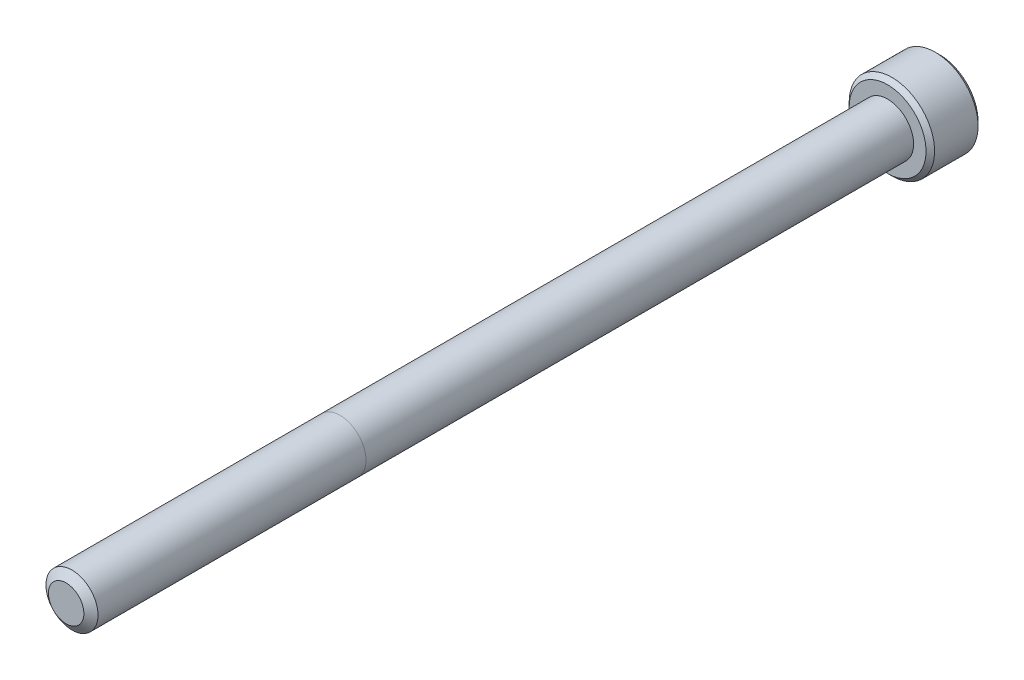
ISO-10303-21;
HEADER;
FILE_DESCRIPTION(('STEP AP214'),'2;1');
FILE_NAME('part.step','',(''),(''),'','','');
FILE_SCHEMA(('AUTOMOTIVE_DESIGN { 1 0 10303 214 1 1 1 1 }'));
ENDSEC;
DATA;
#1=APPLICATION_CONTEXT('core data for automotive mechanical design processes');
#2=APPLICATION_PROTOCOL_DEFINITION('international standard','automotive_design',2000,#1);
#3=PRODUCT_CONTEXT('',#1,'mechanical');
#4=PRODUCT('Part','Part','',(#3));
#5=PRODUCT_RELATED_PRODUCT_CATEGORY('part','',(#4));
#6=PRODUCT_DEFINITION_FORMATION('','',#4);
#7=PRODUCT_DEFINITION_CONTEXT('part definition',#1,'design');
#8=PRODUCT_DEFINITION('design','',#6,#7);
#9=PRODUCT_DEFINITION_SHAPE('','',#8);
#10=(LENGTH_UNIT() NAMED_UNIT(*) SI_UNIT(.MILLI.,.METRE.));
#11=(NAMED_UNIT(*) PLANE_ANGLE_UNIT() SI_UNIT($,.RADIAN.));
#12=(NAMED_UNIT(*) SI_UNIT($,.STERADIAN.) SOLID_ANGLE_UNIT());
#13=UNCERTAINTY_MEASURE_WITH_UNIT(LENGTH_MEASURE(1.E-05),#10,'distance_accuracy_value','');
#14=(GEOMETRIC_REPRESENTATION_CONTEXT(3) GLOBAL_UNCERTAINTY_ASSIGNED_CONTEXT((#13)) GLOBAL_UNIT_ASSIGNED_CONTEXT((#10,
#11,#12)) REPRESENTATION_CONTEXT('',''));
#15=CARTESIAN_POINT('',(0.,0.,0.));
#16=DIRECTION('',(0.,0.,1.));
#17=DIRECTION('',(1.,0.,0.));
#18=AXIS2_PLACEMENT_3D('',#15,#16,#17);
#19=CARTESIAN_POINT('',(0.,0.,-76.2));
#20=DIRECTION('',(0.,0.,1.));
#21=DIRECTION('',(1.,0.,0.));
#22=AXIS2_PLACEMENT_3D('',#19,#20,#21);
#23=CYLINDRICAL_SURFACE('',#22,2.413);
#24=CARTESIAN_POINT('',(0.,0.,-0.538848735955547));
#25=DIRECTION('',(0.,0.,1.));
#26=DIRECTION('',(1.,0.,0.));
#27=AXIS2_PLACEMENT_3D('',#24,#25,#26);
#28=CIRCLE('',#27,2.413);
#29=CARTESIAN_POINT('',(2.413,0.,-0.538848735955547));
#30=VERTEX_POINT('',#29);
#31=EDGE_CURVE('E111',#30,#30,#28,.T.);
#32=ORIENTED_EDGE('',*,*,#31,.F.);
#33=EDGE_LOOP('',(#32));
#34=FACE_BOUND('',#33,.T.);
#35=CARTESIAN_POINT('',(0.,0.,-25.4));
#36=DIRECTION('',(0.,0.,-1.));
#37=DIRECTION('',(-1.,0.,0.));
#38=AXIS2_PLACEMENT_3D('',#35,#36,#37);
#39=CIRCLE('',#38,2.413);
#40=CARTESIAN_POINT('',(2.413,0.,-25.4));
#41=VERTEX_POINT('',#40);
#42=CARTESIAN_POINT('',(-2.413,0.,-25.4));
#43=VERTEX_POINT('',#42);
#44=EDGE_CURVE('E38',#41,#43,#39,.F.);
#45=ORIENTED_EDGE('',*,*,#44,.T.);
#46=EDGE_CURVE('E11',#43,#41,#39,.F.);
#47=ORIENTED_EDGE('',*,*,#46,.T.);
#48=EDGE_LOOP('',(#45,#47));
#49=FACE_BOUND('',#48,.T.);
#50=ADVANCED_FACE('F34',(#34,#49),#23,.T.);
#51=ORIENTED_EDGE('',*,*,#46,.F.);
#52=ORIENTED_EDGE('',*,*,#44,.F.);
#53=EDGE_LOOP('',(#51,#52));
#54=FACE_BOUND('',#53,.T.);
#55=CARTESIAN_POINT('',(0.,0.,-76.2));
#56=DIRECTION('',(0.,0.,-1.));
#57=DIRECTION('',(-1.,0.,0.));
#58=AXIS2_PLACEMENT_3D('',#55,#56,#57);
#59=CIRCLE('',#58,2.413);
#60=CARTESIAN_POINT('',(-2.413,0.,-76.2));
#61=VERTEX_POINT('',#60);
#62=EDGE_CURVE('E195',#61,#61,#59,.F.);
#63=ORIENTED_EDGE('',*,*,#62,.T.);
#64=EDGE_LOOP('',(#63));
#65=FACE_BOUND('',#64,.T.);
#66=ADVANCED_FACE('F188',(#54,#65),#23,.T.);
#67=CARTESIAN_POINT('',(0.,0.,0.));
#68=DIRECTION('',(0.,0.,-1.));
#69=DIRECTION('',(-1.,0.,0.));
#70=AXIS2_PLACEMENT_3D('',#67,#68,#69);
#71=CONICAL_SURFACE('',#70,1.64344425180957,0.959931088596884);
#72=ORIENTED_EDGE('',*,*,#31,.T.);
#73=EDGE_LOOP('',(#72));
#74=FACE_BOUND('',#73,.T.);
#75=CARTESIAN_POINT('',(0.,0.,0.));
#76=DIRECTION('',(0.,0.,1.));
#77=DIRECTION('',(1.,0.,0.));
#78=AXIS2_PLACEMENT_3D('',#75,#76,#77);
#79=CIRCLE('',#78,1.64344425180957);
#80=CARTESIAN_POINT('',(1.64344425180957,0.,0.));
#81=VERTEX_POINT('',#80);
#82=EDGE_CURVE('E197',#81,#81,#79,.T.);
#83=ORIENTED_EDGE('',*,*,#82,.F.);
#84=EDGE_LOOP('',(#83));
#85=FACE_BOUND('',#84,.T.);
#86=ADVANCED_FACE('F191',(#74,#85),#71,.T.);
#87=CARTESIAN_POINT('',(0.,0.,0.));
#88=DIRECTION('',(0.,0.,1.));
#89=DIRECTION('',(1.,0.,0.));
#90=AXIS2_PLACEMENT_3D('',#87,#88,#89);
#91=PLANE('',#90);
#92=ORIENTED_EDGE('',*,*,#82,.T.);
#93=EDGE_LOOP('',(#92));
#94=FACE_BOUND('',#93,.T.);
#95=ADVANCED_FACE('F256',(#94),#91,.T.);
#96=CARTESIAN_POINT('',(0.,0.,-81.026));
#97=DIRECTION('',(0.,0.,1.));
#98=DIRECTION('',(1.,0.,0.));
#99=AXIS2_PLACEMENT_3D('',#96,#97,#98);
#100=CYLINDRICAL_SURFACE('',#99,3.9624);
#101=CARTESIAN_POINT('',(0.,0.,-80.62976));
#102=DIRECTION('',(0.,0.,-1.));
#103=DIRECTION('',(-1.,0.,0.));
#104=AXIS2_PLACEMENT_3D('',#101,#102,#103);
#105=CIRCLE('',#104,3.9624);
#106=CARTESIAN_POINT('',(-3.9624,0.,-80.62976));
#107=VERTEX_POINT('',#106);
#108=EDGE_CURVE('E179',#107,#107,#105,.F.);
#109=ORIENTED_EDGE('',*,*,#108,.T.);
#110=EDGE_LOOP('',(#109));
#111=FACE_BOUND('',#110,.T.);
#112=CARTESIAN_POINT('',(0.,0.,-76.59624));
#113=DIRECTION('',(0.,0.,-1.));
#114=DIRECTION('',(-1.,0.,0.));
#115=AXIS2_PLACEMENT_3D('',#112,#113,#114);
#116=CIRCLE('',#115,3.9624);
#117=CARTESIAN_POINT('',(-3.9624,0.,-76.59624));
#118=VERTEX_POINT('',#117);
#119=EDGE_CURVE('E176',#118,#118,#116,.T.);
#120=ORIENTED_EDGE('',*,*,#119,.T.);
#121=EDGE_LOOP('',(#120));
#122=FACE_BOUND('',#121,.T.);
#123=ADVANCED_FACE('F272',(#111,#122),#100,.T.);
#124=CARTESIAN_POINT('',(0.,0.,-81.026));
#125=DIRECTION('',(0.,0.,-1.));
#126=DIRECTION('',(-1.,0.,0.));
#127=AXIS2_PLACEMENT_3D('',#124,#125,#126);
#128=PLANE('',#127);
#129=CARTESIAN_POINT('',(0.,0.,-81.026));
#130=DIRECTION('',(0.,0.,-1.));
#131=DIRECTION('',(-1.,0.,0.));
#132=AXIS2_PLACEMENT_3D('',#129,#130,#131);
#133=CIRCLE('',#132,3.56615999999998);
#134=CARTESIAN_POINT('',(-3.56615999999998,0.,-81.026));
#135=VERTEX_POINT('',#134);
#136=EDGE_CURVE('E110',#135,#135,#133,.T.);
#137=ORIENTED_EDGE('',*,*,#136,.T.);
#138=EDGE_LOOP('',(#137));
#139=FACE_BOUND('',#138,.T.);
#140=CARTESIAN_POINT('',(0.,0.,-81.026));
#141=DIRECTION('',(0.,0.,-1.));
#142=DIRECTION('',(-1.,0.,0.));
#143=AXIS2_PLACEMENT_3D('',#140,#141,#142);
#144=CIRCLE('',#143,2.29135888084633);
#145=CARTESIAN_POINT('',(-1.984375,1.14567944042316,-81.026));
#146=VERTEX_POINT('',#145);
#147=CARTESIAN_POINT('',(0.,2.29135888084633,-81.026));
#148=VERTEX_POINT('',#147);
#149=EDGE_CURVE('E89',#146,#148,#144,.T.);
#150=ORIENTED_EDGE('',*,*,#149,.F.);
#151=CARTESIAN_POINT('',(-1.984375,-1.14567944042316,-81.026));
#152=VERTEX_POINT('',#151);
#153=EDGE_CURVE('E101',#152,#146,#144,.T.);
#154=ORIENTED_EDGE('',*,*,#153,.F.);
#155=CARTESIAN_POINT('',(0.,-2.29135888084633,-81.026));
#156=VERTEX_POINT('',#155);
#157=EDGE_CURVE('E435',#156,#152,#144,.T.);
#158=ORIENTED_EDGE('',*,*,#157,.F.);
#159=CARTESIAN_POINT('',(1.984375,-1.14567944042316,-81.026));
#160=VERTEX_POINT('',#159);
#161=EDGE_CURVE('E134',#160,#156,#144,.T.);
#162=ORIENTED_EDGE('',*,*,#161,.F.);
#163=CARTESIAN_POINT('',(1.984375,1.14567944042316,-81.026));
#164=VERTEX_POINT('',#163);
#165=EDGE_CURVE('E133',#164,#160,#144,.T.);
#166=ORIENTED_EDGE('',*,*,#165,.F.);
#167=EDGE_CURVE('E99',#148,#164,#144,.T.);
#168=ORIENTED_EDGE('',*,*,#167,.F.);
#169=EDGE_LOOP('',(#150,#154,#158,#162,#166,#168));
#170=FACE_BOUND('',#169,.T.);
#171=ADVANCED_FACE('F131',(#139,#170),#128,.T.);
#172=CARTESIAN_POINT('',(0.,0.,-76.2));
#173=DIRECTION('',(0.,0.,-1.));
#174=DIRECTION('',(-1.,0.,0.));
#175=AXIS2_PLACEMENT_3D('',#172,#173,#174);
#176=PLANE('',#175);
#177=CARTESIAN_POINT('',(0.,0.,-76.2));
#178=DIRECTION('',(0.,0.,-1.));
#179=DIRECTION('',(-1.,0.,0.));
#180=AXIS2_PLACEMENT_3D('',#177,#178,#179);
#181=CIRCLE('',#180,3.56616000000001);
#182=CARTESIAN_POINT('',(-3.56616000000001,0.,-76.2));
#183=VERTEX_POINT('',#182);
#184=EDGE_CURVE('E181',#183,#183,#181,.F.);
#185=ORIENTED_EDGE('',*,*,#184,.T.);
#186=EDGE_LOOP('',(#185));
#187=FACE_BOUND('',#186,.T.);
#188=ORIENTED_EDGE('',*,*,#62,.F.);
#189=EDGE_LOOP('',(#188));
#190=FACE_BOUND('',#189,.T.);
#191=ADVANCED_FACE('F271',(#187,#190),#176,.F.);
#192=CARTESIAN_POINT('',(0.,0.,-81.026));
#193=DIRECTION('',(0.,0.,-1.));
#194=DIRECTION('',(-1.,0.,0.));
#195=AXIS2_PLACEMENT_3D('',#192,#193,#194);
#196=CONICAL_SURFACE('',#195,2.29135888084633,0.78539816339745);
#197=ORIENTED_EDGE('',*,*,#167,.T.);
#198=CARTESIAN_POINT('',(-0.000199999999999745,2.29147435090016,-81.0261154787818));
#199=CARTESIAN_POINT('',(0.068015995166803,2.25208982772757,-80.9867628522639));
#200=CARTESIAN_POINT('',(0.137372685106966,2.21204672412052,-80.9497213104462));
#201=CARTESIAN_POINT('',(0.278798800452188,2.13039431835551,-80.8818988584233));
#202=CARTESIAN_POINT('',(0.350881678736784,2.08877724917394,-80.8511556890918));
#203=CARTESIAN_POINT('',(0.496233397266007,2.00485839535392,-80.7984918888112));
#204=CARTESIAN_POINT('',(0.569465212486941,1.96257798712286,-80.77643887588));
#205=CARTESIAN_POINT('',(0.71754118259471,1.87708628592063,-80.7424614929439));
#206=CARTESIAN_POINT('',(0.792380812753428,1.83387760530244,-80.7305117560917));
#207=CARTESIAN_POINT('',(0.92136041454382,1.75941119748879,-80.7197300990819));
#208=CARTESIAN_POINT('',(0.975333715772446,1.72824969749539,-80.7181338990591));
#209=CARTESIAN_POINT('',(1.0831921185198,1.66597761963484,-80.7208218388653));
#210=CARTESIAN_POINT('',(1.13707718248553,1.63486706344893,-80.7251080403405));
#211=CARTESIAN_POINT('',(1.24433853824861,1.57293969082547,-80.7393168730135));
#212=CARTESIAN_POINT('',(1.29771419276014,1.54212324232506,-80.7492458104523));
#213=CARTESIAN_POINT('',(1.4035425174089,1.48102323060121,-80.7741950842745));
#214=CARTESIAN_POINT('',(1.45599525797111,1.45073962671789,-80.7892150303895));
#215=CARTESIAN_POINT('',(1.59035733896365,1.37316564308797,-80.8338078516357));
#216=CARTESIAN_POINT('',(1.67143335715833,1.32635638215845,-80.8667429959383));
#217=CARTESIAN_POINT('',(1.79064830672984,1.25752759893191,-80.9223424412022));
#218=CARTESIAN_POINT('',(1.829934924386,1.23484545965257,-80.9418775920519));
#219=CARTESIAN_POINT('',(1.90778036186805,1.18990137536713,-80.9827287381194));
#220=CARTESIAN_POINT('',(1.9463396111017,1.16763918244233,-81.0040436395684));
#221=CARTESIAN_POINT('',(1.984575,1.14556397036933,-81.0261154787818));
#222=B_SPLINE_CURVE_WITH_KNOTS('',3,(#198,#199,#200,#201,#202,#203,#204,#205,#206,#207,#208,
#209,#210,#211,#212,#213,#214,#215,#216,#217,#218,#219,#220,#221),.UNSPECIFIED.,.F.,.F.,(4,2,2,
2,2,2,2,2,2,2,2,4),(0.,0.264339630306625,0.530219665093696,0.791876416371465,1.0528742441811,
1.23963984393201,1.42647091743853,1.61351120244035,1.80053715247541,2.09764209964317,
2.24579179873714,2.39385111134157),.UNSPECIFIED.);
#223=EDGE_CURVE('E105',#148,#164,#222,.T.);
#224=ORIENTED_EDGE('',*,*,#223,.F.);
#225=EDGE_LOOP('',(#197,#224));
#226=FACE_BOUND('',#225,.T.);
#227=ADVANCED_FACE('F106',(#226),#196,.F.);
#228=ORIENTED_EDGE('',*,*,#165,.T.);
#229=CARTESIAN_POINT('',(1.984375,-2.28495242157822,-81.7609840788166));
#230=CARTESIAN_POINT('',(1.984375,-2.22931635455402,-81.7189866855508));
#231=CARTESIAN_POINT('',(1.984375,-2.17336876548389,-81.6773960540763));
#232=CARTESIAN_POINT('',(1.984375,-2.06072770258171,-81.5952084614715));
#233=CARTESIAN_POINT('',(1.984375,-2.00403404503435,-81.554611752405));
#234=CARTESIAN_POINT('',(1.984375,-1.88936329173489,-81.4743035031747));
#235=CARTESIAN_POINT('',(1.984375,-1.83137965519348,-81.4346012588133));
#236=CARTESIAN_POINT('',(1.984375,-1.71442802137841,-81.3566851734013));
#237=CARTESIAN_POINT('',(1.984375,-1.65546009407228,-81.3184712271944));
#238=CARTESIAN_POINT('',(1.984375,-1.47005472306036,-81.2022528340136));
#239=CARTESIAN_POINT('',(1.984375,-1.34163909427883,-81.1273478868724));
#240=CARTESIAN_POINT('',(1.984375,-1.07840384705479,-80.9903302154397));
#241=CARTESIAN_POINT('',(1.984375,-0.943607781407422,-80.9281743664824));
#242=CARTESIAN_POINT('',(1.984375,-0.741275100444883,-80.8521325786886));
#243=CARTESIAN_POINT('',(1.984375,-0.676735408881097,-80.830308061326));
#244=CARTESIAN_POINT('',(1.984375,-0.546098118112762,-80.7918404635378));
#245=CARTESIAN_POINT('',(1.984375,-0.480000411919954,-80.7751977400656));
#246=CARTESIAN_POINT('',(1.984375,-0.347746170028529,-80.7482353808697));
#247=CARTESIAN_POINT('',(1.984375,-0.28161207147912,-80.7378074097359));
#248=CARTESIAN_POINT('',(1.984375,-0.148636620052347,-80.7234781473766));
#249=CARTESIAN_POINT('',(1.984375,-0.081795390739321,-80.7195757342274));
#250=CARTESIAN_POINT('',(1.984375,0.0495156750890667,-80.7185870513327));
#251=CARTESIAN_POINT('',(1.984375,0.113983775102993,-80.721259178875));
#252=CARTESIAN_POINT('',(1.984375,0.242367515846178,-80.7327392104975));
#253=CARTESIAN_POINT('',(1.984375,0.306283102295921,-80.7415477106392));
#254=CARTESIAN_POINT('',(1.984375,0.434181040262185,-80.7649690213329));
#255=CARTESIAN_POINT('',(1.984375,0.49814502685831,-80.7796806062321));
#256=CARTESIAN_POINT('',(1.984375,0.624675616953006,-80.8141261814121));
#257=CARTESIAN_POINT('',(1.984375,0.687242336899687,-80.8338597514492));
#258=CARTESIAN_POINT('',(1.984375,0.884225483826081,-80.9034122372308));
#259=CARTESIAN_POINT('',(1.984375,1.01583674256467,-80.9611524112565));
#260=CARTESIAN_POINT('',(1.984375,1.27288659242651,-81.0895303365888));
#261=CARTESIAN_POINT('',(1.984375,1.3983008827048,-81.1602144249194));
#262=CARTESIAN_POINT('',(1.984375,1.57956687990221,-81.2705166638132));
#263=CARTESIAN_POINT('',(1.984375,1.63738271299423,-81.3069698294753));
#264=CARTESIAN_POINT('',(1.984375,1.75202215386201,-81.3814159632917));
#265=CARTESIAN_POINT('',(1.984375,1.8088456860136,-81.419409048078));
#266=CARTESIAN_POINT('',(1.984375,1.92116923084254,-81.4963388088931));
#267=CARTESIAN_POINT('',(1.984375,1.97667624512252,-81.5352653130388));
#268=CARTESIAN_POINT('',(1.984375,2.08693170717165,-81.6141477461214));
#269=CARTESIAN_POINT('',(1.984375,2.14168035934792,-81.654103389024));
#270=CARTESIAN_POINT('',(1.984375,2.19611149046621,-81.6944806112854));
#271=B_SPLINE_CURVE_WITH_KNOTS('',3,(#229,#230,#231,#232,#233,#234,#235,#236,#237,#238,#239,
#240,#241,#242,#243,#244,#245,#246,#247,#248,#249,#250,#251,#252,#253,#254,#255,#256,#257,#258,
#259,#260,#261,#262,#263,#264,#265,#266,#267,#268,#269,#270),.UNSPECIFIED.,.F.,.F.,(4,2,2,2,2,2,
2,2,2,2,2,2,2,2,2,2,2,2,2,2,4),(0.,0.20912607000832,0.418304637356573,0.629103979977991,
0.839888401371184,1.28549951116128,1.72957750768351,1.93379389749972,2.13802435186699,
2.33858179514334,2.5391047535064,2.73236963400795,2.92565329006887,3.12231577097488,
3.31896180041345,3.74886295245171,4.18033428125363,4.38536017180289,4.59040161996381,
4.79377749165106,4.99709743524131),.UNSPECIFIED.);
#272=EDGE_CURVE('E98',#164,#160,#271,.F.);
#273=ORIENTED_EDGE('',*,*,#272,.F.);
#274=EDGE_LOOP('',(#228,#273));
#275=FACE_BOUND('',#274,.T.);
#276=ADVANCED_FACE('F372',(#275),#196,.F.);
#277=ORIENTED_EDGE('',*,*,#161,.T.);
#278=CARTESIAN_POINT('',(1.984575,-1.14556397036933,-81.0261154787818));
#279=CARTESIAN_POINT('',(1.9163590048332,-1.18494849354192,-80.9867628522639));
#280=CARTESIAN_POINT('',(1.84700231489303,-1.22499159714897,-80.9497213104462));
#281=CARTESIAN_POINT('',(1.70557619954781,-1.30664400291398,-80.8818988584233));
#282=CARTESIAN_POINT('',(1.63349332126322,-1.34826107209555,-80.8511556890918));
#283=CARTESIAN_POINT('',(1.48814160273399,-1.43217992591558,-80.7984918888112));
#284=CARTESIAN_POINT('',(1.41490978751306,-1.47446033414663,-80.77643887588));
#285=CARTESIAN_POINT('',(1.26683381740529,-1.55995203534886,-80.7424614929439));
#286=CARTESIAN_POINT('',(1.19199418724657,-1.60316071596705,-80.7305117560917));
#287=CARTESIAN_POINT('',(1.06301458545618,-1.6776271237807,-80.7197300990819));
#288=CARTESIAN_POINT('',(1.00904128422755,-1.7087886237741,-80.7181338990591));
#289=CARTESIAN_POINT('',(0.901182881480196,-1.77106070163465,-80.7208218388653));
#290=CARTESIAN_POINT('',(0.847297817514473,-1.80217125782056,-80.7251080403405));
#291=CARTESIAN_POINT('',(0.740036461751393,-1.86409863044402,-80.7393168730135));
#292=CARTESIAN_POINT('',(0.686660807239856,-1.89491507894443,-80.7492458104523));
#293=CARTESIAN_POINT('',(0.5808324825911,-1.95601509066828,-80.7741950842745));
#294=CARTESIAN_POINT('',(0.528379742028894,-1.9862986945516,-80.7892150303895));
#295=CARTESIAN_POINT('',(0.394017661036347,-2.06387267818153,-80.8338078516357));
#296=CARTESIAN_POINT('',(0.312941642841674,-2.11068193911104,-80.8667429959383));
#297=CARTESIAN_POINT('',(0.19372669327016,-2.17951072233758,-80.9223424412022));
#298=CARTESIAN_POINT('',(0.154440075613998,-2.20219286161692,-80.9418775920519));
#299=CARTESIAN_POINT('',(0.0765946381319472,-2.24713694590237,-80.9827287381194));
#300=CARTESIAN_POINT('',(0.0380353888983012,-2.26939913882716,-81.0040436395684));
#301=CARTESIAN_POINT('',(-0.000199999999999471,-2.29147435090016,-81.0261154787818));
#302=B_SPLINE_CURVE_WITH_KNOTS('',3,(#278,#279,#280,#281,#282,#283,#284,#285,#286,#287,#288,
#289,#290,#291,#292,#293,#294,#295,#296,#297,#298,#299,#300,#301),.UNSPECIFIED.,.F.,.F.,(4,2,2,
2,2,2,2,2,2,2,2,4),(0.,0.264339630306625,0.530219665093697,0.791876416371465,1.0528742441811,
1.23963984393201,1.42647091743853,1.61351120244035,1.80053715247541,2.09764209964317,
2.24579179873713,2.39385111134157),.UNSPECIFIED.);
#303=EDGE_CURVE('E144',#160,#156,#302,.T.);
#304=ORIENTED_EDGE('',*,*,#303,.F.);
#305=EDGE_LOOP('',(#277,#304));
#306=FACE_BOUND('',#305,.T.);
#307=ADVANCED_FACE('F364',(#306),#196,.F.);
#308=ORIENTED_EDGE('',*,*,#157,.T.);
#309=CARTESIAN_POINT('',(0.000200000000000473,-2.29147435090016,-81.0261154787818));
#310=CARTESIAN_POINT('',(-0.0680159951668023,-2.25208982772757,-80.9867628522639));
#311=CARTESIAN_POINT('',(-0.137372685106965,-2.21204672412052,-80.9497213104462));
#312=CARTESIAN_POINT('',(-0.278798800452187,-2.13039431835551,-80.8818988584233));
#313=CARTESIAN_POINT('',(-0.350881678736783,-2.08877724917394,-80.8511556890918));
#314=CARTESIAN_POINT('',(-0.496233397266006,-2.00485839535392,-80.7984918888112));
#315=CARTESIAN_POINT('',(-0.569465212486941,-1.96257798712286,-80.77643887588));
#316=CARTESIAN_POINT('',(-0.71754118259471,-1.87708628592063,-80.7424614929439));
#317=CARTESIAN_POINT('',(-0.792380812753429,-1.83387760530244,-80.7305117560917));
#318=CARTESIAN_POINT('',(-0.92136041454382,-1.75941119748879,-80.7197300990819));
#319=CARTESIAN_POINT('',(-0.975333715772447,-1.72824969749539,-80.7181338990591));
#320=CARTESIAN_POINT('',(-1.08319211851981,-1.66597761963484,-80.7208218388653));
#321=CARTESIAN_POINT('',(-1.13707718248553,-1.63486706344893,-80.7251080403405));
#322=CARTESIAN_POINT('',(-1.24433853824861,-1.57293969082547,-80.7393168730135));
#323=CARTESIAN_POINT('',(-1.29771419276015,-1.54212324232506,-80.7492458104523));
#324=CARTESIAN_POINT('',(-1.4035425174089,-1.48102323060121,-80.7741950842745));
#325=CARTESIAN_POINT('',(-1.45599525797111,-1.45073962671789,-80.7892150303895));
#326=CARTESIAN_POINT('',(-1.59035733896365,-1.37316564308797,-80.8338078516357));
#327=CARTESIAN_POINT('',(-1.67143335715833,-1.32635638215845,-80.8667429959383));
#328=CARTESIAN_POINT('',(-1.79064830672984,-1.25752759893191,-80.9223424412022));
#329=CARTESIAN_POINT('',(-1.829934924386,-1.23484545965257,-80.9418775920519));
#330=CARTESIAN_POINT('',(-1.90778036186806,-1.18990137536712,-80.9827287381194));
#331=CARTESIAN_POINT('',(-1.9463396111017,-1.16763918244233,-81.0040436395683));
#332=CARTESIAN_POINT('',(-1.984575,-1.14556397036933,-81.0261154787818));
#333=B_SPLINE_CURVE_WITH_KNOTS('',3,(#309,#310,#311,#312,#313,#314,#315,#316,#317,#318,#319,
#320,#321,#322,#323,#324,#325,#326,#327,#328,#329,#330,#331,#332),.UNSPECIFIED.,.F.,.F.,(4,2,2,
2,2,2,2,2,2,2,2,4),(0.,0.264339630306625,0.530219665093696,0.791876416371465,1.0528742441811,
1.23963984393201,1.42647091743853,1.61351120244035,1.80053715247541,2.09764209964317,
2.24579179873714,2.39385111134157),.UNSPECIFIED.);
#334=EDGE_CURVE('E233',#156,#152,#333,.T.);
#335=ORIENTED_EDGE('',*,*,#334,.F.);
#336=EDGE_LOOP('',(#308,#335));
#337=FACE_BOUND('',#336,.T.);
#338=ADVANCED_FACE('F356',(#337),#196,.F.);
#339=ORIENTED_EDGE('',*,*,#153,.T.);
#340=CARTESIAN_POINT('',(-1.984375,-2.28495242157822,-81.7609840788166));
#341=CARTESIAN_POINT('',(-1.984375,-2.22931635455402,-81.7189866855508));
#342=CARTESIAN_POINT('',(-1.984375,-2.17336876548389,-81.6773960540763));
#343=CARTESIAN_POINT('',(-1.984375,-2.06072770258171,-81.5952084614715));
#344=CARTESIAN_POINT('',(-1.984375,-2.00403404503435,-81.554611752405));
#345=CARTESIAN_POINT('',(-1.984375,-1.88936329173488,-81.4743035031747));
#346=CARTESIAN_POINT('',(-1.984375,-1.83137965519347,-81.4346012588133));
#347=CARTESIAN_POINT('',(-1.984375,-1.7144280213784,-81.3566851734013));
#348=CARTESIAN_POINT('',(-1.984375,-1.65546009407228,-81.3184712271944));
#349=CARTESIAN_POINT('',(-1.984375,-1.47005472306035,-81.2022528340136));
#350=CARTESIAN_POINT('',(-1.984375,-1.34163909427883,-81.1273478868724));
#351=CARTESIAN_POINT('',(-1.984375,-1.07840384705479,-80.9903302154397));
#352=CARTESIAN_POINT('',(-1.984375,-0.943607781407421,-80.9281743664824));
#353=CARTESIAN_POINT('',(-1.984375,-0.741275100444883,-80.8521325786886));
#354=CARTESIAN_POINT('',(-1.984375,-0.676735408881097,-80.830308061326));
#355=CARTESIAN_POINT('',(-1.984375,-0.546098118112762,-80.7918404635378));
#356=CARTESIAN_POINT('',(-1.984375,-0.480000411919954,-80.7751977400656));
#357=CARTESIAN_POINT('',(-1.984375,-0.347746170028529,-80.7482353808697));
#358=CARTESIAN_POINT('',(-1.984375,-0.28161207147912,-80.7378074097359));
#359=CARTESIAN_POINT('',(-1.984375,-0.148636620052347,-80.7234781473766));
#360=CARTESIAN_POINT('',(-1.984375,-0.0817953907393209,-80.7195757342274));
#361=CARTESIAN_POINT('',(-1.984375,0.0495156750890665,-80.7185870513327));
#362=CARTESIAN_POINT('',(-1.984375,0.113983775102993,-80.721259178875));
#363=CARTESIAN_POINT('',(-1.984375,0.242367515846177,-80.7327392104975));
#364=CARTESIAN_POINT('',(-1.984375,0.306283102295919,-80.7415477106392));
#365=CARTESIAN_POINT('',(-1.984375,0.434181040262183,-80.7649690213329));
#366=CARTESIAN_POINT('',(-1.984375,0.498145026858309,-80.7796806062321));
#367=CARTESIAN_POINT('',(-1.984375,0.624675616953006,-80.8141261814121));
#368=CARTESIAN_POINT('',(-1.984375,0.687242336899686,-80.8338597514492));
#369=CARTESIAN_POINT('',(-1.984375,0.884225483826081,-80.9034122372308));
#370=CARTESIAN_POINT('',(-1.984375,1.01583674256467,-80.9611524112565));
#371=CARTESIAN_POINT('',(-1.984375,1.27288659242651,-81.0895303365888));
#372=CARTESIAN_POINT('',(-1.984375,1.3983008827048,-81.1602144249194));
#373=CARTESIAN_POINT('',(-1.984375,1.57956687990221,-81.2705166638132));
#374=CARTESIAN_POINT('',(-1.984375,1.63738271299423,-81.3069698294753));
#375=CARTESIAN_POINT('',(-1.984375,1.75202215386201,-81.3814159632917));
#376=CARTESIAN_POINT('',(-1.984375,1.80884568601361,-81.419409048078));
#377=CARTESIAN_POINT('',(-1.984375,1.92116923084254,-81.4963388088931));
#378=CARTESIAN_POINT('',(-1.984375,1.97667624512252,-81.5352653130388));
#379=CARTESIAN_POINT('',(-1.984375,2.08693170717165,-81.6141477461214));
#380=CARTESIAN_POINT('',(-1.984375,2.14168035934792,-81.654103389024));
#381=CARTESIAN_POINT('',(-1.984375,2.19611149046621,-81.6944806112854));
#382=B_SPLINE_CURVE_WITH_KNOTS('',3,(#340,#341,#342,#343,#344,#345,#346,#347,#348,#349,#350,
#351,#352,#353,#354,#355,#356,#357,#358,#359,#360,#361,#362,#363,#364,#365,#366,#367,#368,#369,
#370,#371,#372,#373,#374,#375,#376,#377,#378,#379,#380,#381),.UNSPECIFIED.,.F.,.F.,(4,2,2,2,2,2,
2,2,2,2,2,2,2,2,2,2,2,2,2,2,4),(0.,0.20912607000832,0.418304637356573,0.629103979978009,
0.839888401371184,1.28549951116128,1.72957750768351,1.93379389749972,2.13802435186698,
2.33858179514334,2.5391047535064,2.73236963400795,2.92565329006887,3.12231577097488,
3.31896180041345,3.74886295245171,4.18033428125363,4.38536017180289,4.59040161996382,
4.79377749165106,4.99709743524131),.UNSPECIFIED.);
#383=EDGE_CURVE('E121',#152,#146,#382,.T.);
#384=ORIENTED_EDGE('',*,*,#383,.F.);
#385=EDGE_LOOP('',(#339,#384));
#386=FACE_BOUND('',#385,.T.);
#387=ADVANCED_FACE('F348',(#386),#196,.F.);
#388=ORIENTED_EDGE('',*,*,#149,.T.);
#389=CARTESIAN_POINT('',(-1.984575,1.14556397036933,-81.0261154787818));
#390=CARTESIAN_POINT('',(-1.9163590048332,1.18494849354192,-80.9867628522639));
#391=CARTESIAN_POINT('',(-1.84700231489303,1.22499159714897,-80.9497213104462));
#392=CARTESIAN_POINT('',(-1.70557619954781,1.30664400291398,-80.8818988584233));
#393=CARTESIAN_POINT('',(-1.63349332126322,1.34826107209555,-80.8511556890918));
#394=CARTESIAN_POINT('',(-1.48814160273399,1.43217992591557,-80.7984918888112));
#395=CARTESIAN_POINT('',(-1.41490978751306,1.47446033414663,-80.77643887588));
#396=CARTESIAN_POINT('',(-1.26683381740529,1.55995203534886,-80.7424614929439));
#397=CARTESIAN_POINT('',(-1.19199418724657,1.60316071596705,-80.7305117560917));
#398=CARTESIAN_POINT('',(-1.06301458545618,1.6776271237807,-80.7197300990819));
#399=CARTESIAN_POINT('',(-1.00904128422755,1.7087886237741,-80.7181338990591));
#400=CARTESIAN_POINT('',(-0.901182881480194,1.77106070163465,-80.7208218388653));
#401=CARTESIAN_POINT('',(-0.847297817514471,1.80217125782056,-80.7251080403405));
#402=CARTESIAN_POINT('',(-0.74003646175139,1.86409863044402,-80.7393168730135));
#403=CARTESIAN_POINT('',(-0.686660807239855,1.89491507894443,-80.7492458104523));
#404=CARTESIAN_POINT('',(-0.580832482591099,1.95601509066828,-80.7741950842745));
#405=CARTESIAN_POINT('',(-0.528379742028894,1.9862986945516,-80.7892150303895));
#406=CARTESIAN_POINT('',(-0.394017661036347,2.06387267818152,-80.8338078516357));
#407=CARTESIAN_POINT('',(-0.312941642841674,2.11068193911104,-80.8667429959383));
#408=CARTESIAN_POINT('',(-0.19372669327016,2.17951072233758,-80.9223424412022));
#409=CARTESIAN_POINT('',(-0.154440075613998,2.20219286161692,-80.9418775920519));
#410=CARTESIAN_POINT('',(-0.0765946381319465,2.24713694590237,-80.9827287381194));
#411=CARTESIAN_POINT('',(-0.0380353888983005,2.26939913882716,-81.0040436395684));
#412=CARTESIAN_POINT('',(0.000200000000000119,2.29147435090016,-81.0261154787818));
#413=B_SPLINE_CURVE_WITH_KNOTS('',3,(#389,#390,#391,#392,#393,#394,#395,#396,#397,#398,#399,
#400,#401,#402,#403,#404,#405,#406,#407,#408,#409,#410,#411,#412),.UNSPECIFIED.,.F.,.F.,(4,2,2,
2,2,2,2,2,2,2,2,4),(0.,0.264339630306625,0.530219665093696,0.791876416371465,1.0528742441811,
1.23963984393201,1.42647091743853,1.61351120244035,1.80053715247541,2.09764209964317,
2.24579179873714,2.39385111134157),.UNSPECIFIED.);
#414=EDGE_CURVE('E93',#146,#148,#413,.T.);
#415=ORIENTED_EDGE('',*,*,#414,.F.);
#416=EDGE_LOOP('',(#388,#415));
#417=FACE_BOUND('',#416,.T.);
#418=ADVANCED_FACE('F91',(#417),#196,.F.);
#419=CARTESIAN_POINT('',(1.984375,3.43703832126949,-78.0494375));
#420=DIRECTION('',(0.,0.,-1.));
#421=DIRECTION('',(-1.,0.,0.));
#422=AXIS2_PLACEMENT_3D('',#419,#420,#421);
#423=PLANE('',#422);
#424=DIRECTION('',(0.866025403784439,0.5,0.));
#425=VECTOR('',#424,1.);
#426=CARTESIAN_POINT('',(-1.984375,1.14567944042316,-78.0494375));
#427=LINE('',#426,#425);
#428=CARTESIAN_POINT('',(-1.984375,1.14567944042316,-78.0494375));
#429=VERTEX_POINT('',#428);
#430=CARTESIAN_POINT('',(0.,2.29135888084633,-78.0494375));
#431=VERTEX_POINT('',#430);
#432=EDGE_CURVE('E120',#429,#431,#427,.T.);
#433=ORIENTED_EDGE('',*,*,#432,.T.);
#434=DIRECTION('',(0.866025403784439,-0.5,0.));
#435=VECTOR('',#434,1.);
#436=CARTESIAN_POINT('',(0.,2.29135888084633,-78.0494375));
#437=LINE('',#436,#435);
#438=CARTESIAN_POINT('',(1.984375,1.14567944042316,-78.0494375));
#439=VERTEX_POINT('',#438);
#440=EDGE_CURVE('E125',#431,#439,#437,.T.);
#441=ORIENTED_EDGE('',*,*,#440,.T.);
#442=DIRECTION('',(0.,-1.,0.));
#443=VECTOR('',#442,1.);
#444=CARTESIAN_POINT('',(1.984375,1.14567944042316,-78.0494375));
#445=LINE('',#444,#443);
#446=CARTESIAN_POINT('',(1.984375,-1.14567944042316,-78.0494375));
#447=VERTEX_POINT('',#446);
#448=EDGE_CURVE('E219',#439,#447,#445,.T.);
#449=ORIENTED_EDGE('',*,*,#448,.T.);
#450=DIRECTION('',(-0.866025403784439,-0.5,0.));
#451=VECTOR('',#450,1.);
#452=CARTESIAN_POINT('',(1.984375,-1.14567944042316,-78.0494375));
#453=LINE('',#452,#451);
#454=CARTESIAN_POINT('',(0.,-2.29135888084633,-78.0494375));
#455=VERTEX_POINT('',#454);
#456=EDGE_CURVE('E216',#447,#455,#453,.T.);
#457=ORIENTED_EDGE('',*,*,#456,.T.);
#458=DIRECTION('',(-0.866025403784439,0.5,0.));
#459=VECTOR('',#458,1.);
#460=CARTESIAN_POINT('',(0.,-2.29135888084633,-78.0494375));
#461=LINE('',#460,#459);
#462=CARTESIAN_POINT('',(-1.984375,-1.14567944042316,-78.0494375));
#463=VERTEX_POINT('',#462);
#464=EDGE_CURVE('E213',#455,#463,#461,.T.);
#465=ORIENTED_EDGE('',*,*,#464,.T.);
#466=DIRECTION('',(0.,1.,0.));
#467=VECTOR('',#466,1.);
#468=CARTESIAN_POINT('',(-1.984375,-1.14567944042316,-78.0494375));
#469=LINE('',#468,#467);
#470=EDGE_CURVE('E128',#463,#429,#469,.T.);
#471=ORIENTED_EDGE('',*,*,#470,.T.);
#472=EDGE_LOOP('',(#433,#441,#449,#457,#465,#471));
#473=FACE_BOUND('',#472,.T.);
#474=ADVANCED_FACE('F164',(#473),#423,.T.);
#475=CARTESIAN_POINT('',(0.,2.29135888084633,-78.0494375));
#476=DIRECTION('',(0.5,0.866025403784439,0.));
#477=DIRECTION('',(-0.866025403784439,0.5,0.));
#478=AXIS2_PLACEMENT_3D('',#475,#476,#477);
#479=PLANE('',#478);
#480=DIRECTION('',(0.,0.,-1.));
#481=VECTOR('',#480,1.);
#482=CARTESIAN_POINT('',(0.,2.29135888084633,-78.0494375));
#483=LINE('',#482,#481);
#484=EDGE_CURVE('E117',#431,#148,#483,.T.);
#485=ORIENTED_EDGE('',*,*,#484,.T.);
#486=ORIENTED_EDGE('',*,*,#223,.T.);
#487=DIRECTION('',(0.,0.,-1.));
#488=VECTOR('',#487,1.);
#489=CARTESIAN_POINT('',(1.984375,1.14567944042316,-78.0494375));
#490=LINE('',#489,#488);
#491=EDGE_CURVE('E127',#439,#164,#490,.T.);
#492=ORIENTED_EDGE('',*,*,#491,.F.);
#493=ORIENTED_EDGE('',*,*,#440,.F.);
#494=EDGE_LOOP('',(#485,#486,#492,#493));
#495=FACE_BOUND('',#494,.T.);
#496=ADVANCED_FACE('F123',(#495),#479,.F.);
#497=CARTESIAN_POINT('',(1.984375,1.14567944042316,-78.0494375));
#498=DIRECTION('',(1.,0.,0.));
#499=DIRECTION('',(0.,0.,-1.));
#500=AXIS2_PLACEMENT_3D('',#497,#498,#499);
#501=PLANE('',#500);
#502=ORIENTED_EDGE('',*,*,#491,.T.);
#503=ORIENTED_EDGE('',*,*,#272,.T.);
#504=DIRECTION('',(0.,0.,-1.));
#505=VECTOR('',#504,1.);
#506=CARTESIAN_POINT('',(1.984375,-1.14567944042316,-78.0494375));
#507=LINE('',#506,#505);
#508=EDGE_CURVE('E204',#447,#160,#507,.T.);
#509=ORIENTED_EDGE('',*,*,#508,.F.);
#510=ORIENTED_EDGE('',*,*,#448,.F.);
#511=EDGE_LOOP('',(#502,#503,#509,#510));
#512=FACE_BOUND('',#511,.T.);
#513=ADVANCED_FACE('F153',(#512),#501,.F.);
#514=CARTESIAN_POINT('',(1.984375,-1.14567944042316,-78.0494375));
#515=DIRECTION('',(0.5,-0.866025403784439,0.));
#516=DIRECTION('',(0.866025403784439,0.5,0.));
#517=AXIS2_PLACEMENT_3D('',#514,#515,#516);
#518=PLANE('',#517);
#519=ORIENTED_EDGE('',*,*,#508,.T.);
#520=ORIENTED_EDGE('',*,*,#303,.T.);
#521=DIRECTION('',(0.,0.,-1.));
#522=VECTOR('',#521,1.);
#523=CARTESIAN_POINT('',(0.,-2.29135888084633,-78.0494375));
#524=LINE('',#523,#522);
#525=EDGE_CURVE('E207',#455,#156,#524,.T.);
#526=ORIENTED_EDGE('',*,*,#525,.F.);
#527=ORIENTED_EDGE('',*,*,#456,.F.);
#528=EDGE_LOOP('',(#519,#520,#526,#527));
#529=FACE_BOUND('',#528,.T.);
#530=ADVANCED_FACE('F157',(#529),#518,.F.);
#531=CARTESIAN_POINT('',(0.,-2.29135888084633,-78.0494375));
#532=DIRECTION('',(-0.5,-0.866025403784439,0.));
#533=DIRECTION('',(0.866025403784439,-0.5,0.));
#534=AXIS2_PLACEMENT_3D('',#531,#532,#533);
#535=PLANE('',#534);
#536=ORIENTED_EDGE('',*,*,#525,.T.);
#537=ORIENTED_EDGE('',*,*,#334,.T.);
#538=DIRECTION('',(0.,0.,-1.));
#539=VECTOR('',#538,1.);
#540=CARTESIAN_POINT('',(-1.984375,-1.14567944042316,-78.0494375));
#541=LINE('',#540,#539);
#542=EDGE_CURVE('E200',#463,#152,#541,.T.);
#543=ORIENTED_EDGE('',*,*,#542,.F.);
#544=ORIENTED_EDGE('',*,*,#464,.F.);
#545=EDGE_LOOP('',(#536,#537,#543,#544));
#546=FACE_BOUND('',#545,.T.);
#547=ADVANCED_FACE('F241',(#546),#535,.F.);
#548=CARTESIAN_POINT('',(-1.984375,-1.14567944042316,-78.0494375));
#549=DIRECTION('',(-1.,0.,0.));
#550=DIRECTION('',(0.,0.,1.));
#551=AXIS2_PLACEMENT_3D('',#548,#549,#550);
#552=PLANE('',#551);
#553=ORIENTED_EDGE('',*,*,#542,.T.);
#554=ORIENTED_EDGE('',*,*,#383,.T.);
#555=DIRECTION('',(0.,0.,-1.));
#556=VECTOR('',#555,1.);
#557=CARTESIAN_POINT('',(-1.984375,1.14567944042316,-78.0494375));
#558=LINE('',#557,#556);
#559=EDGE_CURVE('E119',#429,#146,#558,.T.);
#560=ORIENTED_EDGE('',*,*,#559,.F.);
#561=ORIENTED_EDGE('',*,*,#470,.F.);
#562=EDGE_LOOP('',(#553,#554,#560,#561));
#563=FACE_BOUND('',#562,.T.);
#564=ADVANCED_FACE('F238',(#563),#552,.F.);
#565=CARTESIAN_POINT('',(-1.984375,1.14567944042316,-78.0494375));
#566=DIRECTION('',(-0.5,0.866025403784439,0.));
#567=DIRECTION('',(-0.866025403784439,-0.5,0.));
#568=AXIS2_PLACEMENT_3D('',#565,#566,#567);
#569=PLANE('',#568);
#570=ORIENTED_EDGE('',*,*,#559,.T.);
#571=ORIENTED_EDGE('',*,*,#414,.T.);
#572=ORIENTED_EDGE('',*,*,#484,.F.);
#573=ORIENTED_EDGE('',*,*,#432,.F.);
#574=EDGE_LOOP('',(#570,#571,#572,#573));
#575=FACE_BOUND('',#574,.T.);
#576=ADVANCED_FACE('F115',(#575),#569,.F.);
#577=CARTESIAN_POINT('',(0.,0.,-81.026));
#578=DIRECTION('',(0.,0.,1.));
#579=DIRECTION('',(1.,0.,0.));
#580=AXIS2_PLACEMENT_3D('',#577,#578,#579);
#581=CONICAL_SURFACE('',#580,3.56615999999998,0.785398163397433);
#582=ORIENTED_EDGE('',*,*,#108,.F.);
#583=EDGE_LOOP('',(#582));
#584=FACE_BOUND('',#583,.T.);
#585=ORIENTED_EDGE('',*,*,#136,.F.);
#586=EDGE_LOOP('',(#585));
#587=FACE_BOUND('',#586,.T.);
#588=ADVANCED_FACE('F258',(#584,#587),#581,.T.);
#589=CARTESIAN_POINT('',(0.,0.,-76.59624));
#590=DIRECTION('',(0.,0.,-1.));
#591=DIRECTION('',(-1.,0.,0.));
#592=AXIS2_PLACEMENT_3D('',#589,#590,#591);
#593=CONICAL_SURFACE('',#592,3.9624,0.78539816339745);
#594=ORIENTED_EDGE('',*,*,#184,.F.);
#595=EDGE_LOOP('',(#594));
#596=FACE_BOUND('',#595,.T.);
#597=ORIENTED_EDGE('',*,*,#119,.F.);
#598=EDGE_LOOP('',(#597));
#599=FACE_BOUND('',#598,.T.);
#600=ADVANCED_FACE('F36',(#596,#599),#593,.T.);
#601=CLOSED_SHELL('',(#50,#66,#86,#95,#123,#171,#191,#227,#276,#307,#338,#387,#418,#474,#496,
#513,#530,#547,#564,#576,#588,#600));
#602=MANIFOLD_SOLID_BREP('B2',#601);
#603=ADVANCED_BREP_SHAPE_REPRESENTATION('',(#18,#602),#14);
#604=SHAPE_DEFINITION_REPRESENTATION(#9,#603);
ENDSEC;
END-ISO-10303-21;
